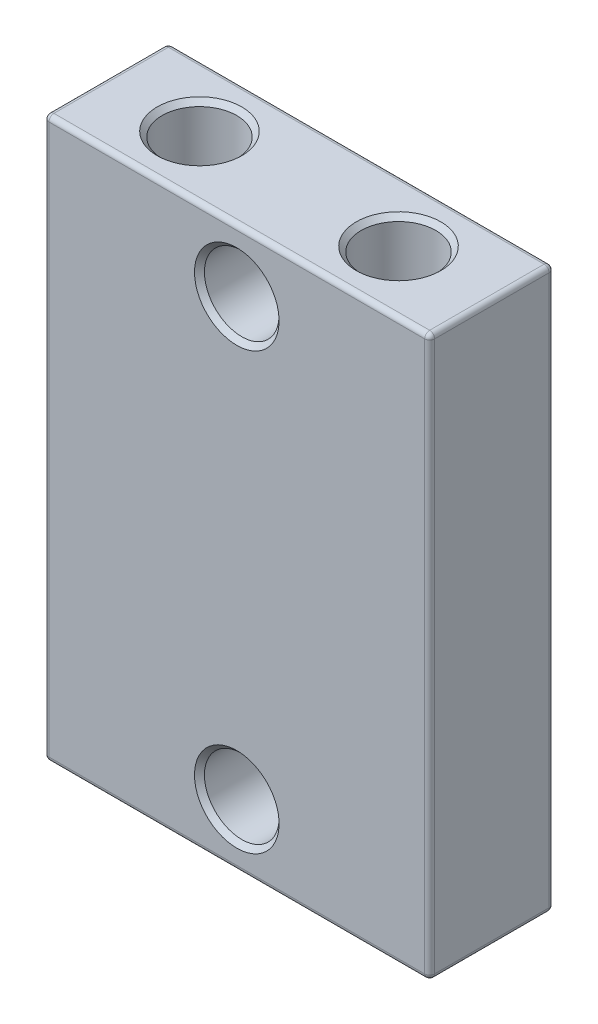
ISO-10303-21;
HEADER;
FILE_DESCRIPTION(('STEP AP214'),'2;1');
FILE_NAME('part.step','',(''),(''),'','','');
FILE_SCHEMA(('AUTOMOTIVE_DESIGN { 1 0 10303 214 1 1 1 1 }'));
ENDSEC;
DATA;
#1=APPLICATION_CONTEXT('core data for automotive mechanical design processes');
#2=APPLICATION_PROTOCOL_DEFINITION('international standard','automotive_design',2000,#1);
#3=PRODUCT_CONTEXT('',#1,'mechanical');
#4=PRODUCT('Part','Part','',(#3));
#5=PRODUCT_RELATED_PRODUCT_CATEGORY('part','',(#4));
#6=PRODUCT_DEFINITION_FORMATION('','',#4);
#7=PRODUCT_DEFINITION_CONTEXT('part definition',#1,'design');
#8=PRODUCT_DEFINITION('design','',#6,#7);
#9=PRODUCT_DEFINITION_SHAPE('','',#8);
#10=(LENGTH_UNIT() NAMED_UNIT(*) SI_UNIT(.MILLI.,.METRE.));
#11=(NAMED_UNIT(*) PLANE_ANGLE_UNIT() SI_UNIT($,.RADIAN.));
#12=(NAMED_UNIT(*) SI_UNIT($,.STERADIAN.) SOLID_ANGLE_UNIT());
#13=UNCERTAINTY_MEASURE_WITH_UNIT(LENGTH_MEASURE(1.E-05),#10,'distance_accuracy_value','');
#14=(GEOMETRIC_REPRESENTATION_CONTEXT(3) GLOBAL_UNCERTAINTY_ASSIGNED_CONTEXT((#13)) GLOBAL_UNIT_ASSIGNED_CONTEXT((#10,
#11,#12)) REPRESENTATION_CONTEXT('',''));
#15=CARTESIAN_POINT('',(0.,0.,0.));
#16=DIRECTION('',(0.,0.,1.));
#17=DIRECTION('',(1.,0.,0.));
#18=AXIS2_PLACEMENT_3D('',#15,#16,#17);
#19=CARTESIAN_POINT('',(7.75,-11.25,5.));
#20=DIRECTION('',(-1.,0.,0.));
#21=DIRECTION('',(0.,0.,1.));
#22=AXIS2_PLACEMENT_3D('',#19,#20,#21);
#23=PLANE('',#22);
#24=DIRECTION('',(0.,0.,-1.));
#25=VECTOR('',#24,1.);
#26=CARTESIAN_POINT('',(7.75,11.05,5.));
#27=LINE('',#26,#25);
#28=CARTESIAN_POINT('',(7.75,11.05,0.2));
#29=VERTEX_POINT('',#28);
#30=CARTESIAN_POINT('',(7.75,11.05,4.8));
#31=VERTEX_POINT('',#30);
#32=EDGE_CURVE('E165',#29,#31,#27,.F.);
#33=ORIENTED_EDGE('',*,*,#32,.T.);
#34=DIRECTION('',(0.,1.,0.));
#35=VECTOR('',#34,1.);
#36=CARTESIAN_POINT('',(7.75,-11.25,4.8));
#37=LINE('',#36,#35);
#38=CARTESIAN_POINT('',(7.75,-11.05,4.8));
#39=VERTEX_POINT('',#38);
#40=EDGE_CURVE('E128',#31,#39,#37,.F.);
#41=ORIENTED_EDGE('',*,*,#40,.T.);
#42=DIRECTION('',(0.,0.,-1.));
#43=VECTOR('',#42,1.);
#44=CARTESIAN_POINT('',(7.75,-11.05,5.));
#45=LINE('',#44,#43);
#46=CARTESIAN_POINT('',(7.75,-11.05,0.2));
#47=VERTEX_POINT('',#46);
#48=EDGE_CURVE('E157',#39,#47,#45,.T.);
#49=ORIENTED_EDGE('',*,*,#48,.T.);
#50=DIRECTION('',(0.,1.,0.));
#51=VECTOR('',#50,1.);
#52=CARTESIAN_POINT('',(7.75,11.25,0.2));
#53=LINE('',#52,#51);
#54=EDGE_CURVE('E159',#47,#29,#53,.T.);
#55=ORIENTED_EDGE('',*,*,#54,.T.);
#56=EDGE_LOOP('',(#33,#41,#49,#55));
#57=FACE_BOUND('',#56,.T.);
#58=ADVANCED_FACE('F33',(#57),#23,.F.);
#59=CARTESIAN_POINT('',(-7.75,11.25,5.));
#60=DIRECTION('',(0.,-1.,0.));
#61=DIRECTION('',(0.,0.,-1.));
#62=AXIS2_PLACEMENT_3D('',#59,#60,#61);
#63=PLANE('',#62);
#64=CARTESIAN_POINT('',(4.,11.25,2.5));
#65=DIRECTION('',(0.,-1.,0.));
#66=DIRECTION('',(0.,0.,-1.));
#67=AXIS2_PLACEMENT_3D('',#64,#65,#66);
#68=CIRCLE('',#67,1.70000000000001);
#69=CARTESIAN_POINT('',(4.,11.25,0.799999999999995));
#70=VERTEX_POINT('',#69);
#71=EDGE_CURVE('E41',#70,#70,#68,.T.);
#72=ORIENTED_EDGE('',*,*,#71,.T.);
#73=EDGE_LOOP('',(#72));
#74=FACE_BOUND('',#73,.T.);
#75=CARTESIAN_POINT('',(-4.,11.25,2.5));
#76=DIRECTION('',(0.,-1.,0.));
#77=DIRECTION('',(0.,0.,-1.));
#78=AXIS2_PLACEMENT_3D('',#75,#76,#77);
#79=CIRCLE('',#78,1.70000000000001);
#80=CARTESIAN_POINT('',(-4.,11.25,0.799999999999995));
#81=VERTEX_POINT('',#80);
#82=EDGE_CURVE('E278',#81,#81,#79,.T.);
#83=ORIENTED_EDGE('',*,*,#82,.T.);
#84=EDGE_LOOP('',(#83));
#85=FACE_BOUND('',#84,.T.);
#86=DIRECTION('',(0.,0.,-1.));
#87=VECTOR('',#86,1.);
#88=CARTESIAN_POINT('',(-7.55,11.25,5.));
#89=LINE('',#88,#87);
#90=CARTESIAN_POINT('',(-7.55,11.25,0.2));
#91=VERTEX_POINT('',#90);
#92=CARTESIAN_POINT('',(-7.55,11.25,4.8));
#93=VERTEX_POINT('',#92);
#94=EDGE_CURVE('E170',#91,#93,#89,.F.);
#95=ORIENTED_EDGE('',*,*,#94,.T.);
#96=DIRECTION('',(-1.,0.,0.));
#97=VECTOR('',#96,1.);
#98=CARTESIAN_POINT('',(-7.75,11.25,4.8));
#99=LINE('',#98,#97);
#100=CARTESIAN_POINT('',(7.55,11.25,4.8));
#101=VERTEX_POINT('',#100);
#102=EDGE_CURVE('E175',#93,#101,#99,.F.);
#103=ORIENTED_EDGE('',*,*,#102,.T.);
#104=DIRECTION('',(0.,0.,-1.));
#105=VECTOR('',#104,1.);
#106=CARTESIAN_POINT('',(7.55,11.25,5.));
#107=LINE('',#106,#105);
#108=CARTESIAN_POINT('',(7.55,11.25,0.2));
#109=VERTEX_POINT('',#108);
#110=EDGE_CURVE('E172',#101,#109,#107,.T.);
#111=ORIENTED_EDGE('',*,*,#110,.T.);
#112=DIRECTION('',(-1.,0.,0.));
#113=VECTOR('',#112,1.);
#114=CARTESIAN_POINT('',(-7.75,11.25,0.2));
#115=LINE('',#114,#113);
#116=EDGE_CURVE('E168',#109,#91,#115,.T.);
#117=ORIENTED_EDGE('',*,*,#116,.T.);
#118=EDGE_LOOP('',(#95,#103,#111,#117));
#119=FACE_BOUND('',#118,.T.);
#120=ADVANCED_FACE('F283',(#74,#85,#119),#63,.F.);
#121=CARTESIAN_POINT('',(-7.75,-11.25,5.));
#122=DIRECTION('',(1.,0.,0.));
#123=DIRECTION('',(0.,0.,-1.));
#124=AXIS2_PLACEMENT_3D('',#121,#122,#123);
#125=PLANE('',#124);
#126=DIRECTION('',(0.,-1.,0.));
#127=VECTOR('',#126,1.);
#128=CARTESIAN_POINT('',(-7.75,-11.25,4.8));
#129=LINE('',#128,#127);
#130=CARTESIAN_POINT('',(-7.75,-11.05,4.8));
#131=VERTEX_POINT('',#130);
#132=CARTESIAN_POINT('',(-7.75,11.05,4.8));
#133=VERTEX_POINT('',#132);
#134=EDGE_CURVE('E48',#131,#133,#129,.F.);
#135=ORIENTED_EDGE('',*,*,#134,.T.);
#136=DIRECTION('',(0.,0.,-1.));
#137=VECTOR('',#136,1.);
#138=CARTESIAN_POINT('',(-7.75,11.05,5.));
#139=LINE('',#138,#137);
#140=CARTESIAN_POINT('',(-7.75,11.05,0.2));
#141=VERTEX_POINT('',#140);
#142=EDGE_CURVE('E199',#133,#141,#139,.T.);
#143=ORIENTED_EDGE('',*,*,#142,.T.);
#144=DIRECTION('',(0.,-1.,0.));
#145=VECTOR('',#144,1.);
#146=CARTESIAN_POINT('',(-7.75,-11.25,0.2));
#147=LINE('',#146,#145);
#148=CARTESIAN_POINT('',(-7.75,-11.05,0.2));
#149=VERTEX_POINT('',#148);
#150=EDGE_CURVE('E195',#141,#149,#147,.T.);
#151=ORIENTED_EDGE('',*,*,#150,.T.);
#152=DIRECTION('',(0.,0.,-1.));
#153=VECTOR('',#152,1.);
#154=CARTESIAN_POINT('',(-7.75,-11.05,5.));
#155=LINE('',#154,#153);
#156=EDGE_CURVE('E53',#149,#131,#155,.F.);
#157=ORIENTED_EDGE('',*,*,#156,.T.);
#158=EDGE_LOOP('',(#135,#143,#151,#157));
#159=FACE_BOUND('',#158,.T.);
#160=ADVANCED_FACE('F360',(#159),#125,.F.);
#161=CARTESIAN_POINT('',(-7.75,-11.25,5.));
#162=DIRECTION('',(0.,1.,0.));
#163=DIRECTION('',(0.,0.,1.));
#164=AXIS2_PLACEMENT_3D('',#161,#162,#163);
#165=PLANE('',#164);
#166=DIRECTION('',(0.,0.,-1.));
#167=VECTOR('',#166,1.);
#168=CARTESIAN_POINT('',(7.55,-11.25,5.));
#169=LINE('',#168,#167);
#170=CARTESIAN_POINT('',(7.55,-11.25,0.2));
#171=VERTEX_POINT('',#170);
#172=CARTESIAN_POINT('',(7.55,-11.25,4.8));
#173=VERTEX_POINT('',#172);
#174=EDGE_CURVE('E190',#171,#173,#169,.F.);
#175=ORIENTED_EDGE('',*,*,#174,.T.);
#176=DIRECTION('',(1.,0.,0.));
#177=VECTOR('',#176,1.);
#178=CARTESIAN_POINT('',(-7.75,-11.25,4.8));
#179=LINE('',#178,#177);
#180=CARTESIAN_POINT('',(-7.55,-11.25,4.8));
#181=VERTEX_POINT('',#180);
#182=EDGE_CURVE('E192',#173,#181,#179,.F.);
#183=ORIENTED_EDGE('',*,*,#182,.T.);
#184=DIRECTION('',(0.,0.,-1.));
#185=VECTOR('',#184,1.);
#186=CARTESIAN_POINT('',(-7.55,-11.25,5.));
#187=LINE('',#186,#185);
#188=CARTESIAN_POINT('',(-7.55,-11.25,0.2));
#189=VERTEX_POINT('',#188);
#190=EDGE_CURVE('E186',#181,#189,#187,.T.);
#191=ORIENTED_EDGE('',*,*,#190,.T.);
#192=DIRECTION('',(1.,0.,0.));
#193=VECTOR('',#192,1.);
#194=CARTESIAN_POINT('',(7.75,-11.25,0.2));
#195=LINE('',#194,#193);
#196=EDGE_CURVE('E188',#189,#171,#195,.T.);
#197=ORIENTED_EDGE('',*,*,#196,.T.);
#198=EDGE_LOOP('',(#175,#183,#191,#197));
#199=FACE_BOUND('',#198,.T.);
#200=ADVANCED_FACE('F626',(#199),#165,.F.);
#201=CARTESIAN_POINT('',(0.,0.,5.));
#202=DIRECTION('',(0.,0.,-1.));
#203=DIRECTION('',(-1.,0.,0.));
#204=AXIS2_PLACEMENT_3D('',#201,#202,#203);
#205=PLANE('',#204);
#206=CARTESIAN_POINT('',(0.,-8.75,5.));
#207=DIRECTION('',(0.,0.,-1.));
#208=DIRECTION('',(-1.,0.,0.));
#209=AXIS2_PLACEMENT_3D('',#206,#207,#208);
#210=CIRCLE('',#209,1.7);
#211=CARTESIAN_POINT('',(-1.7,-8.75,5.));
#212=VERTEX_POINT('',#211);
#213=EDGE_CURVE('E263',#212,#212,#210,.T.);
#214=ORIENTED_EDGE('',*,*,#213,.T.);
#215=EDGE_LOOP('',(#214));
#216=FACE_BOUND('',#215,.T.);
#217=CARTESIAN_POINT('',(0.,8.75,5.));
#218=DIRECTION('',(0.,0.,-1.));
#219=DIRECTION('',(-1.,0.,0.));
#220=AXIS2_PLACEMENT_3D('',#217,#218,#219);
#221=CIRCLE('',#220,1.7);
#222=CARTESIAN_POINT('',(-1.7,8.75,5.));
#223=VERTEX_POINT('',#222);
#224=EDGE_CURVE('E260',#223,#223,#221,.T.);
#225=ORIENTED_EDGE('',*,*,#224,.T.);
#226=EDGE_LOOP('',(#225));
#227=FACE_BOUND('',#226,.T.);
#228=DIRECTION('',(1.,0.,0.));
#229=VECTOR('',#228,1.);
#230=CARTESIAN_POINT('',(0.,-11.05,5.));
#231=LINE('',#230,#229);
#232=CARTESIAN_POINT('',(-7.55,-11.05,5.));
#233=VERTEX_POINT('',#232);
#234=CARTESIAN_POINT('',(7.55,-11.05,5.));
#235=VERTEX_POINT('',#234);
#236=EDGE_CURVE('E155',#233,#235,#231,.T.);
#237=ORIENTED_EDGE('',*,*,#236,.T.);
#238=DIRECTION('',(0.,1.,0.));
#239=VECTOR('',#238,1.);
#240=CARTESIAN_POINT('',(7.55,0.,5.));
#241=LINE('',#240,#239);
#242=CARTESIAN_POINT('',(7.55,11.05,5.));
#243=VERTEX_POINT('',#242);
#244=EDGE_CURVE('E126',#235,#243,#241,.T.);
#245=ORIENTED_EDGE('',*,*,#244,.T.);
#246=DIRECTION('',(-1.,0.,0.));
#247=VECTOR('',#246,1.);
#248=CARTESIAN_POINT('',(0.,11.05,5.));
#249=LINE('',#248,#247);
#250=CARTESIAN_POINT('',(-7.55,11.05,5.));
#251=VERTEX_POINT('',#250);
#252=EDGE_CURVE('E144',#243,#251,#249,.T.);
#253=ORIENTED_EDGE('',*,*,#252,.T.);
#254=DIRECTION('',(0.,-1.,0.));
#255=VECTOR('',#254,1.);
#256=CARTESIAN_POINT('',(-7.55,0.,5.));
#257=LINE('',#256,#255);
#258=EDGE_CURVE('E150',#251,#233,#257,.T.);
#259=ORIENTED_EDGE('',*,*,#258,.T.);
#260=EDGE_LOOP('',(#237,#245,#253,#259));
#261=FACE_BOUND('',#260,.T.);
#262=ADVANCED_FACE('F153',(#216,#227,#261),#205,.F.);
#263=CARTESIAN_POINT('',(0.,0.,0.));
#264=DIRECTION('',(0.,0.,-1.));
#265=DIRECTION('',(-1.,0.,0.));
#266=AXIS2_PLACEMENT_3D('',#263,#264,#265);
#267=PLANE('',#266);
#268=CARTESIAN_POINT('',(0.,8.75,0.));
#269=DIRECTION('',(0.,0.,-1.));
#270=DIRECTION('',(-1.,0.,0.));
#271=AXIS2_PLACEMENT_3D('',#268,#269,#270);
#272=CIRCLE('',#271,1.7);
#273=CARTESIAN_POINT('',(-1.7,8.75,0.));
#274=VERTEX_POINT('',#273);
#275=EDGE_CURVE('E272',#274,#274,#272,.F.);
#276=ORIENTED_EDGE('',*,*,#275,.T.);
#277=EDGE_LOOP('',(#276));
#278=FACE_BOUND('',#277,.T.);
#279=DIRECTION('',(-1.,0.,0.));
#280=VECTOR('',#279,1.);
#281=CARTESIAN_POINT('',(7.75,11.05,0.));
#282=LINE('',#281,#280);
#283=CARTESIAN_POINT('',(-7.55,11.05,0.));
#284=VERTEX_POINT('',#283);
#285=CARTESIAN_POINT('',(7.55,11.05,0.));
#286=VERTEX_POINT('',#285);
#287=EDGE_CURVE('E177',#284,#286,#282,.F.);
#288=ORIENTED_EDGE('',*,*,#287,.T.);
#289=DIRECTION('',(0.,1.,0.));
#290=VECTOR('',#289,1.);
#291=CARTESIAN_POINT('',(7.55,-11.25,0.));
#292=LINE('',#291,#290);
#293=CARTESIAN_POINT('',(7.55,-11.05,0.));
#294=VERTEX_POINT('',#293);
#295=EDGE_CURVE('E183',#286,#294,#292,.F.);
#296=ORIENTED_EDGE('',*,*,#295,.T.);
#297=DIRECTION('',(1.,0.,0.));
#298=VECTOR('',#297,1.);
#299=CARTESIAN_POINT('',(-7.75,-11.05,0.));
#300=LINE('',#299,#298);
#301=CARTESIAN_POINT('',(-7.55,-11.05,0.));
#302=VERTEX_POINT('',#301);
#303=EDGE_CURVE('E181',#294,#302,#300,.F.);
#304=ORIENTED_EDGE('',*,*,#303,.T.);
#305=DIRECTION('',(0.,-1.,0.));
#306=VECTOR('',#305,1.);
#307=CARTESIAN_POINT('',(-7.55,11.25,0.));
#308=LINE('',#307,#306);
#309=EDGE_CURVE('E179',#302,#284,#308,.F.);
#310=ORIENTED_EDGE('',*,*,#309,.T.);
#311=EDGE_LOOP('',(#288,#296,#304,#310));
#312=FACE_BOUND('',#311,.T.);
#313=CARTESIAN_POINT('',(0.,-8.75,0.));
#314=DIRECTION('',(0.,0.,1.));
#315=DIRECTION('',(1.,0.,0.));
#316=AXIS2_PLACEMENT_3D('',#313,#314,#315);
#317=CIRCLE('',#316,1.5);
#318=CARTESIAN_POINT('',(1.5,-8.75,0.));
#319=VERTEX_POINT('',#318);
#320=EDGE_CURVE('E151',#319,#319,#317,.T.);
#321=ORIENTED_EDGE('',*,*,#320,.T.);
#322=EDGE_LOOP('',(#321));
#323=FACE_BOUND('',#322,.T.);
#324=ADVANCED_FACE('F609',(#278,#312,#323),#267,.T.);
#325=CARTESIAN_POINT('',(0.,8.75,0.));
#326=DIRECTION('',(0.,0.,1.));
#327=DIRECTION('',(1.,0.,0.));
#328=AXIS2_PLACEMENT_3D('',#325,#326,#327);
#329=CYLINDRICAL_SURFACE('',#328,1.5);
#330=CARTESIAN_POINT('',(0.,8.75,4.80000000000001));
#331=DIRECTION('',(0.,0.,-1.));
#332=DIRECTION('',(-1.,0.,0.));
#333=AXIS2_PLACEMENT_3D('',#330,#331,#332);
#334=CIRCLE('',#333,1.5);
#335=CARTESIAN_POINT('',(-1.5,8.75,4.80000000000001));
#336=VERTEX_POINT('',#335);
#337=EDGE_CURVE('E269',#336,#336,#334,.F.);
#338=ORIENTED_EDGE('',*,*,#337,.T.);
#339=EDGE_LOOP('',(#338));
#340=FACE_BOUND('',#339,.T.);
#341=CARTESIAN_POINT('',(0.,8.75,0.199999999999999));
#342=DIRECTION('',(0.,0.,-1.));
#343=DIRECTION('',(-1.,0.,0.));
#344=AXIS2_PLACEMENT_3D('',#341,#342,#343);
#345=CIRCLE('',#344,1.5);
#346=CARTESIAN_POINT('',(-1.5,8.75,0.199999999999999));
#347=VERTEX_POINT('',#346);
#348=EDGE_CURVE('E266',#347,#347,#345,.T.);
#349=ORIENTED_EDGE('',*,*,#348,.T.);
#350=EDGE_LOOP('',(#349));
#351=FACE_BOUND('',#350,.T.);
#352=ADVANCED_FACE('F600',(#340,#351),#329,.F.);
#353=CARTESIAN_POINT('',(0.,-8.75,0.));
#354=DIRECTION('',(0.,0.,1.));
#355=DIRECTION('',(1.,0.,0.));
#356=AXIS2_PLACEMENT_3D('',#353,#354,#355);
#357=CYLINDRICAL_SURFACE('',#356,1.5);
#358=CARTESIAN_POINT('',(0.,-8.75,4.80000000000001));
#359=DIRECTION('',(0.,0.,-1.));
#360=DIRECTION('',(-1.,0.,0.));
#361=AXIS2_PLACEMENT_3D('',#358,#359,#360);
#362=CIRCLE('',#361,1.5);
#363=CARTESIAN_POINT('',(-1.5,-8.75,4.80000000000001));
#364=VERTEX_POINT('',#363);
#365=EDGE_CURVE('E200',#364,#364,#362,.F.);
#366=ORIENTED_EDGE('',*,*,#365,.T.);
#367=EDGE_LOOP('',(#366));
#368=FACE_BOUND('',#367,.T.);
#369=ORIENTED_EDGE('',*,*,#320,.F.);
#370=EDGE_LOOP('',(#369));
#371=FACE_BOUND('',#370,.T.);
#372=ADVANCED_FACE('F591',(#368,#371),#357,.F.);
#373=CARTESIAN_POINT('',(-4.,3.25,2.5));
#374=DIRECTION('',(0.,1.,0.));
#375=DIRECTION('',(0.,0.,1.));
#376=AXIS2_PLACEMENT_3D('',#373,#374,#375);
#377=CYLINDRICAL_SURFACE('',#376,1.5);
#378=CARTESIAN_POINT('',(-4.,11.05,2.5));
#379=DIRECTION('',(0.,-1.,0.));
#380=DIRECTION('',(0.,0.,-1.));
#381=AXIS2_PLACEMENT_3D('',#378,#379,#380);
#382=CIRCLE('',#381,1.5);
#383=CARTESIAN_POINT('',(-4.,11.05,1.));
#384=VERTEX_POINT('',#383);
#385=EDGE_CURVE('E11',#384,#384,#382,.F.);
#386=ORIENTED_EDGE('',*,*,#385,.T.);
#387=EDGE_LOOP('',(#386));
#388=FACE_BOUND('',#387,.T.);
#389=CARTESIAN_POINT('',(-4.,3.25,2.5));
#390=DIRECTION('',(0.,1.,0.));
#391=DIRECTION('',(0.,0.,1.));
#392=AXIS2_PLACEMENT_3D('',#389,#390,#391);
#393=CIRCLE('',#392,1.5);
#394=CARTESIAN_POINT('',(-4.,3.25,4.));
#395=VERTEX_POINT('',#394);
#396=EDGE_CURVE('E301',#395,#395,#393,.T.);
#397=ORIENTED_EDGE('',*,*,#396,.F.);
#398=EDGE_LOOP('',(#397));
#399=FACE_BOUND('',#398,.T.);
#400=ADVANCED_FACE('F583',(#388,#399),#377,.F.);
#401=CARTESIAN_POINT('',(-4.,3.25,2.5));
#402=DIRECTION('',(0.,1.,0.));
#403=DIRECTION('',(0.,0.,1.));
#404=AXIS2_PLACEMENT_3D('',#401,#402,#403);
#405=PLANE('',#404);
#406=ORIENTED_EDGE('',*,*,#396,.T.);
#407=EDGE_LOOP('',(#406));
#408=FACE_BOUND('',#407,.T.);
#409=ADVANCED_FACE('F296',(#408),#405,.T.);
#410=CARTESIAN_POINT('',(4.,3.25,2.5));
#411=DIRECTION('',(0.,1.,0.));
#412=DIRECTION('',(0.,0.,1.));
#413=AXIS2_PLACEMENT_3D('',#410,#411,#412);
#414=CYLINDRICAL_SURFACE('',#413,1.5);
#415=CARTESIAN_POINT('',(4.,11.05,2.5));
#416=DIRECTION('',(0.,-1.,0.));
#417=DIRECTION('',(0.,0.,-1.));
#418=AXIS2_PLACEMENT_3D('',#415,#416,#417);
#419=CIRCLE('',#418,1.5);
#420=CARTESIAN_POINT('',(4.,11.05,1.));
#421=VERTEX_POINT('',#420);
#422=EDGE_CURVE('E275',#421,#421,#419,.F.);
#423=ORIENTED_EDGE('',*,*,#422,.T.);
#424=EDGE_LOOP('',(#423));
#425=FACE_BOUND('',#424,.T.);
#426=CARTESIAN_POINT('',(4.,3.25,2.5));
#427=DIRECTION('',(0.,1.,0.));
#428=DIRECTION('',(0.,0.,1.));
#429=AXIS2_PLACEMENT_3D('',#426,#427,#428);
#430=CIRCLE('',#429,1.5);
#431=CARTESIAN_POINT('',(4.,3.25,4.));
#432=VERTEX_POINT('',#431);
#433=EDGE_CURVE('E257',#432,#432,#430,.T.);
#434=ORIENTED_EDGE('',*,*,#433,.F.);
#435=EDGE_LOOP('',(#434));
#436=FACE_BOUND('',#435,.T.);
#437=ADVANCED_FACE('F292',(#425,#436),#414,.F.);
#438=CARTESIAN_POINT('',(4.,3.25,2.5));
#439=DIRECTION('',(0.,1.,0.));
#440=DIRECTION('',(0.,0.,1.));
#441=AXIS2_PLACEMENT_3D('',#438,#439,#440);
#442=PLANE('',#441);
#443=ORIENTED_EDGE('',*,*,#433,.T.);
#444=EDGE_LOOP('',(#443));
#445=FACE_BOUND('',#444,.T.);
#446=ADVANCED_FACE('F295',(#445),#442,.T.);
#447=CARTESIAN_POINT('',(-7.55,-11.25,0.2));
#448=DIRECTION('',(0.,1.,0.));
#449=DIRECTION('',(0.,0.,1.));
#450=AXIS2_PLACEMENT_3D('',#447,#448,#449);
#451=CYLINDRICAL_SURFACE('',#450,0.2);
#452=CARTESIAN_POINT('',(-7.55,-11.05,0.2));
#453=DIRECTION('',(0.,-1.,0.));
#454=DIRECTION('',(0.,0.,-1.));
#455=AXIS2_PLACEMENT_3D('',#452,#453,#454);
#456=CIRCLE('',#455,0.2);
#457=EDGE_CURVE('E254',#149,#302,#456,.T.);
#458=ORIENTED_EDGE('',*,*,#457,.F.);
#459=ORIENTED_EDGE('',*,*,#150,.F.);
#460=CARTESIAN_POINT('',(-7.55,11.05,0.2));
#461=DIRECTION('',(0.,1.,0.));
#462=DIRECTION('',(-1.,0.,0.));
#463=AXIS2_PLACEMENT_3D('',#460,#461,#462);
#464=CIRCLE('',#463,0.2);
#465=EDGE_CURVE('E251',#284,#141,#464,.T.);
#466=ORIENTED_EDGE('',*,*,#465,.F.);
#467=ORIENTED_EDGE('',*,*,#309,.F.);
#468=EDGE_LOOP('',(#458,#459,#466,#467));
#469=FACE_BOUND('',#468,.T.);
#470=ADVANCED_FACE('F553',(#469),#451,.T.);
#471=CARTESIAN_POINT('',(-7.55,-11.05,0.2));
#472=DIRECTION('',(0.,0.,1.));
#473=DIRECTION('',(1.,0.,0.));
#474=AXIS2_PLACEMENT_3D('',#471,#472,#473);
#475=SPHERICAL_SURFACE('',#474,0.2);
#476=CARTESIAN_POINT('',(-7.55,-11.05,0.2));
#477=DIRECTION('',(0.,0.,-1.));
#478=DIRECTION('',(-1.,0.,0.));
#479=AXIS2_PLACEMENT_3D('',#476,#477,#478);
#480=CIRCLE('',#479,0.2);
#481=EDGE_CURVE('E245',#149,#189,#480,.F.);
#482=ORIENTED_EDGE('',*,*,#481,.F.);
#483=ORIENTED_EDGE('',*,*,#457,.T.);
#484=CARTESIAN_POINT('',(-7.55,-11.05,0.2));
#485=DIRECTION('',(-1.,0.,0.));
#486=DIRECTION('',(0.,0.,1.));
#487=AXIS2_PLACEMENT_3D('',#484,#485,#486);
#488=CIRCLE('',#487,0.2);
#489=EDGE_CURVE('E248',#189,#302,#488,.F.);
#490=ORIENTED_EDGE('',*,*,#489,.F.);
#491=EDGE_LOOP('',(#482,#483,#490));
#492=FACE_BOUND('',#491,.T.);
#493=ADVANCED_FACE('F544',(#492),#475,.T.);
#494=CARTESIAN_POINT('',(-7.55,11.05,0.2));
#495=DIRECTION('',(0.,0.,1.));
#496=DIRECTION('',(1.,0.,0.));
#497=AXIS2_PLACEMENT_3D('',#494,#495,#496);
#498=SPHERICAL_SURFACE('',#497,0.2);
#499=CARTESIAN_POINT('',(-7.55,11.05,0.2));
#500=DIRECTION('',(-1.,0.,0.));
#501=DIRECTION('',(0.,0.,1.));
#502=AXIS2_PLACEMENT_3D('',#499,#500,#501);
#503=CIRCLE('',#502,0.2);
#504=EDGE_CURVE('E240',#284,#91,#503,.F.);
#505=ORIENTED_EDGE('',*,*,#504,.F.);
#506=ORIENTED_EDGE('',*,*,#465,.T.);
#507=CARTESIAN_POINT('',(-7.55,11.05,0.2));
#508=DIRECTION('',(0.,0.,-1.));
#509=DIRECTION('',(-1.,0.,0.));
#510=AXIS2_PLACEMENT_3D('',#507,#508,#509);
#511=CIRCLE('',#510,0.2);
#512=EDGE_CURVE('E243',#91,#141,#511,.F.);
#513=ORIENTED_EDGE('',*,*,#512,.F.);
#514=EDGE_LOOP('',(#505,#506,#513));
#515=FACE_BOUND('',#514,.T.);
#516=ADVANCED_FACE('F535',(#515),#498,.T.);
#517=CARTESIAN_POINT('',(-7.75,-11.05,0.2));
#518=DIRECTION('',(-1.,0.,0.));
#519=DIRECTION('',(0.,0.,1.));
#520=AXIS2_PLACEMENT_3D('',#517,#518,#519);
#521=CYLINDRICAL_SURFACE('',#520,0.2);
#522=ORIENTED_EDGE('',*,*,#489,.T.);
#523=ORIENTED_EDGE('',*,*,#303,.F.);
#524=CARTESIAN_POINT('',(7.55,-11.05,0.2));
#525=DIRECTION('',(1.,0.,0.));
#526=DIRECTION('',(0.,0.,-1.));
#527=AXIS2_PLACEMENT_3D('',#524,#525,#526);
#528=CIRCLE('',#527,0.2);
#529=EDGE_CURVE('E235',#171,#294,#528,.T.);
#530=ORIENTED_EDGE('',*,*,#529,.F.);
#531=ORIENTED_EDGE('',*,*,#196,.F.);
#532=EDGE_LOOP('',(#522,#523,#530,#531));
#533=FACE_BOUND('',#532,.T.);
#534=ADVANCED_FACE('F526',(#533),#521,.T.);
#535=CARTESIAN_POINT('',(-7.55,-11.05,5.));
#536=DIRECTION('',(0.,0.,-1.));
#537=DIRECTION('',(-1.,0.,0.));
#538=AXIS2_PLACEMENT_3D('',#535,#536,#537);
#539=CYLINDRICAL_SURFACE('',#538,0.2);
#540=ORIENTED_EDGE('',*,*,#481,.T.);
#541=ORIENTED_EDGE('',*,*,#190,.F.);
#542=CARTESIAN_POINT('',(-7.55,-11.05,4.8));
#543=DIRECTION('',(0.,0.,1.));
#544=DIRECTION('',(1.,0.,0.));
#545=AXIS2_PLACEMENT_3D('',#542,#543,#544);
#546=CIRCLE('',#545,0.2);
#547=EDGE_CURVE('E232',#131,#181,#546,.T.);
#548=ORIENTED_EDGE('',*,*,#547,.F.);
#549=ORIENTED_EDGE('',*,*,#156,.F.);
#550=EDGE_LOOP('',(#540,#541,#548,#549));
#551=FACE_BOUND('',#550,.T.);
#552=ADVANCED_FACE('F518',(#551),#539,.T.);
#553=CARTESIAN_POINT('',(-7.55,0.,4.8));
#554=DIRECTION('',(0.,-1.,0.));
#555=DIRECTION('',(0.,0.,-1.));
#556=AXIS2_PLACEMENT_3D('',#553,#554,#555);
#557=CYLINDRICAL_SURFACE('',#556,0.2);
#558=CARTESIAN_POINT('',(-7.55,11.05,4.8));
#559=DIRECTION('',(0.,1.,0.));
#560=DIRECTION('',(0.,0.,1.));
#561=AXIS2_PLACEMENT_3D('',#558,#559,#560);
#562=CIRCLE('',#561,0.2);
#563=EDGE_CURVE('E226',#133,#251,#562,.T.);
#564=ORIENTED_EDGE('',*,*,#563,.F.);
#565=ORIENTED_EDGE('',*,*,#134,.F.);
#566=CARTESIAN_POINT('',(-7.55,-11.05,4.8));
#567=DIRECTION('',(0.,-1.,0.));
#568=DIRECTION('',(0.,0.,-1.));
#569=AXIS2_PLACEMENT_3D('',#566,#567,#568);
#570=CIRCLE('',#569,0.2);
#571=EDGE_CURVE('E229',#233,#131,#570,.T.);
#572=ORIENTED_EDGE('',*,*,#571,.F.);
#573=ORIENTED_EDGE('',*,*,#258,.F.);
#574=EDGE_LOOP('',(#564,#565,#572,#573));
#575=FACE_BOUND('',#574,.T.);
#576=ADVANCED_FACE('F311',(#575),#557,.T.);
#577=CARTESIAN_POINT('',(-7.55,11.05,5.));
#578=DIRECTION('',(0.,0.,-1.));
#579=DIRECTION('',(-1.,0.,0.));
#580=AXIS2_PLACEMENT_3D('',#577,#578,#579);
#581=CYLINDRICAL_SURFACE('',#580,0.2);
#582=ORIENTED_EDGE('',*,*,#512,.T.);
#583=ORIENTED_EDGE('',*,*,#142,.F.);
#584=CARTESIAN_POINT('',(-7.55,11.05,4.8));
#585=DIRECTION('',(0.,0.,1.));
#586=DIRECTION('',(1.,0.,0.));
#587=AXIS2_PLACEMENT_3D('',#584,#585,#586);
#588=CIRCLE('',#587,0.2);
#589=EDGE_CURVE('E223',#93,#133,#588,.T.);
#590=ORIENTED_EDGE('',*,*,#589,.F.);
#591=ORIENTED_EDGE('',*,*,#94,.F.);
#592=EDGE_LOOP('',(#582,#583,#590,#591));
#593=FACE_BOUND('',#592,.T.);
#594=ADVANCED_FACE('F341',(#593),#581,.T.);
#595=CARTESIAN_POINT('',(-7.75,11.05,0.2));
#596=DIRECTION('',(1.,0.,0.));
#597=DIRECTION('',(0.,0.,-1.));
#598=AXIS2_PLACEMENT_3D('',#595,#596,#597);
#599=CYLINDRICAL_SURFACE('',#598,0.2);
#600=ORIENTED_EDGE('',*,*,#504,.T.);
#601=ORIENTED_EDGE('',*,*,#116,.F.);
#602=CARTESIAN_POINT('',(7.55,11.05,0.2));
#603=DIRECTION('',(1.,0.,0.));
#604=DIRECTION('',(0.,1.,0.));
#605=AXIS2_PLACEMENT_3D('',#602,#603,#604);
#606=CIRCLE('',#605,0.2);
#607=EDGE_CURVE('E220',#286,#109,#606,.T.);
#608=ORIENTED_EDGE('',*,*,#607,.F.);
#609=ORIENTED_EDGE('',*,*,#287,.F.);
#610=EDGE_LOOP('',(#600,#601,#608,#609));
#611=FACE_BOUND('',#610,.T.);
#612=ADVANCED_FACE('F494',(#611),#599,.T.);
#613=CARTESIAN_POINT('',(7.55,-11.25,0.2));
#614=DIRECTION('',(0.,-1.,0.));
#615=DIRECTION('',(0.,0.,-1.));
#616=AXIS2_PLACEMENT_3D('',#613,#614,#615);
#617=CYLINDRICAL_SURFACE('',#616,0.2);
#618=CARTESIAN_POINT('',(7.55,-11.05,0.2));
#619=DIRECTION('',(0.,-1.,0.));
#620=DIRECTION('',(0.,0.,-1.));
#621=AXIS2_PLACEMENT_3D('',#618,#619,#620);
#622=CIRCLE('',#621,0.2);
#623=EDGE_CURVE('E237',#294,#47,#622,.T.);
#624=ORIENTED_EDGE('',*,*,#623,.F.);
#625=ORIENTED_EDGE('',*,*,#295,.F.);
#626=CARTESIAN_POINT('',(7.55,11.05,0.2));
#627=DIRECTION('',(0.,1.,0.));
#628=DIRECTION('',(0.,0.,1.));
#629=AXIS2_PLACEMENT_3D('',#626,#627,#628);
#630=CIRCLE('',#629,0.2);
#631=EDGE_CURVE('E217',#29,#286,#630,.T.);
#632=ORIENTED_EDGE('',*,*,#631,.F.);
#633=ORIENTED_EDGE('',*,*,#54,.F.);
#634=EDGE_LOOP('',(#624,#625,#632,#633));
#635=FACE_BOUND('',#634,.T.);
#636=ADVANCED_FACE('F485',(#635),#617,.T.);
#637=CARTESIAN_POINT('',(7.55,-11.05,0.2));
#638=DIRECTION('',(0.,0.,1.));
#639=DIRECTION('',(1.,0.,0.));
#640=AXIS2_PLACEMENT_3D('',#637,#638,#639);
#641=SPHERICAL_SURFACE('',#640,0.2);
#642=ORIENTED_EDGE('',*,*,#529,.T.);
#643=ORIENTED_EDGE('',*,*,#623,.T.);
#644=CARTESIAN_POINT('',(7.55,-11.05,0.2));
#645=DIRECTION('',(0.,0.,-1.));
#646=DIRECTION('',(-1.,0.,0.));
#647=AXIS2_PLACEMENT_3D('',#644,#645,#646);
#648=CIRCLE('',#647,0.2);
#649=EDGE_CURVE('E214',#171,#47,#648,.F.);
#650=ORIENTED_EDGE('',*,*,#649,.F.);
#651=EDGE_LOOP('',(#642,#643,#650));
#652=FACE_BOUND('',#651,.T.);
#653=ADVANCED_FACE('F353',(#652),#641,.T.);
#654=CARTESIAN_POINT('',(-7.55,-11.05,4.8));
#655=DIRECTION('',(0.,0.,1.));
#656=DIRECTION('',(1.,0.,0.));
#657=AXIS2_PLACEMENT_3D('',#654,#655,#656);
#658=SPHERICAL_SURFACE('',#657,0.2);
#659=ORIENTED_EDGE('',*,*,#571,.T.);
#660=ORIENTED_EDGE('',*,*,#547,.T.);
#661=CARTESIAN_POINT('',(-7.55,-11.05,4.8));
#662=DIRECTION('',(-1.,0.,0.));
#663=DIRECTION('',(0.,0.,1.));
#664=AXIS2_PLACEMENT_3D('',#661,#662,#663);
#665=CIRCLE('',#664,0.2);
#666=EDGE_CURVE('E212',#233,#181,#665,.F.);
#667=ORIENTED_EDGE('',*,*,#666,.F.);
#668=EDGE_LOOP('',(#659,#660,#667));
#669=FACE_BOUND('',#668,.T.);
#670=ADVANCED_FACE('F314',(#669),#658,.T.);
#671=CARTESIAN_POINT('',(-7.55,11.05,4.8));
#672=DIRECTION('',(0.,0.,1.));
#673=DIRECTION('',(1.,0.,0.));
#674=AXIS2_PLACEMENT_3D('',#671,#672,#673);
#675=SPHERICAL_SURFACE('',#674,0.2);
#676=ORIENTED_EDGE('',*,*,#589,.T.);
#677=ORIENTED_EDGE('',*,*,#563,.T.);
#678=CARTESIAN_POINT('',(-7.55,11.05,4.8));
#679=DIRECTION('',(-1.,0.,0.));
#680=DIRECTION('',(0.,0.,1.));
#681=AXIS2_PLACEMENT_3D('',#678,#679,#680);
#682=CIRCLE('',#681,0.2);
#683=EDGE_CURVE('E147',#93,#251,#682,.F.);
#684=ORIENTED_EDGE('',*,*,#683,.F.);
#685=EDGE_LOOP('',(#676,#677,#684));
#686=FACE_BOUND('',#685,.T.);
#687=ADVANCED_FACE('F343',(#686),#675,.T.);
#688=CARTESIAN_POINT('',(7.55,11.05,0.2));
#689=DIRECTION('',(0.,0.,1.));
#690=DIRECTION('',(1.,0.,0.));
#691=AXIS2_PLACEMENT_3D('',#688,#689,#690);
#692=SPHERICAL_SURFACE('',#691,0.2);
#693=ORIENTED_EDGE('',*,*,#631,.T.);
#694=ORIENTED_EDGE('',*,*,#607,.T.);
#695=CARTESIAN_POINT('',(7.55,11.05,0.2));
#696=DIRECTION('',(0.,0.,-1.));
#697=DIRECTION('',(-1.,0.,0.));
#698=AXIS2_PLACEMENT_3D('',#695,#696,#697);
#699=CIRCLE('',#698,0.2);
#700=EDGE_CURVE('E209',#29,#109,#699,.F.);
#701=ORIENTED_EDGE('',*,*,#700,.F.);
#702=EDGE_LOOP('',(#693,#694,#701));
#703=FACE_BOUND('',#702,.T.);
#704=ADVANCED_FACE('F345',(#703),#692,.T.);
#705=CARTESIAN_POINT('',(7.55,-11.05,5.));
#706=DIRECTION('',(0.,0.,-1.));
#707=DIRECTION('',(-1.,0.,0.));
#708=AXIS2_PLACEMENT_3D('',#705,#706,#707);
#709=CYLINDRICAL_SURFACE('',#708,0.2);
#710=ORIENTED_EDGE('',*,*,#649,.T.);
#711=ORIENTED_EDGE('',*,*,#48,.F.);
#712=CARTESIAN_POINT('',(7.55,-11.05,4.8));
#713=DIRECTION('',(0.,0.,1.));
#714=DIRECTION('',(1.,0.,0.));
#715=AXIS2_PLACEMENT_3D('',#712,#713,#714);
#716=CIRCLE('',#715,0.2);
#717=EDGE_CURVE('E206',#173,#39,#716,.T.);
#718=ORIENTED_EDGE('',*,*,#717,.F.);
#719=ORIENTED_EDGE('',*,*,#174,.F.);
#720=EDGE_LOOP('',(#710,#711,#718,#719));
#721=FACE_BOUND('',#720,.T.);
#722=ADVANCED_FACE('F326',(#721),#709,.T.);
#723=CARTESIAN_POINT('',(0.,-11.05,4.8));
#724=DIRECTION('',(1.,0.,0.));
#725=DIRECTION('',(0.,0.,-1.));
#726=AXIS2_PLACEMENT_3D('',#723,#724,#725);
#727=CYLINDRICAL_SURFACE('',#726,0.2);
#728=ORIENTED_EDGE('',*,*,#666,.T.);
#729=ORIENTED_EDGE('',*,*,#182,.F.);
#730=CARTESIAN_POINT('',(7.55,-11.05,4.8));
#731=DIRECTION('',(1.,0.,0.));
#732=DIRECTION('',(0.,0.,-1.));
#733=AXIS2_PLACEMENT_3D('',#730,#731,#732);
#734=CIRCLE('',#733,0.2);
#735=EDGE_CURVE('E141',#235,#173,#734,.T.);
#736=ORIENTED_EDGE('',*,*,#735,.F.);
#737=ORIENTED_EDGE('',*,*,#236,.F.);
#738=EDGE_LOOP('',(#728,#729,#736,#737));
#739=FACE_BOUND('',#738,.T.);
#740=ADVANCED_FACE('F318',(#739),#727,.T.);
#741=CARTESIAN_POINT('',(0.,11.05,4.8));
#742=DIRECTION('',(-1.,0.,0.));
#743=DIRECTION('',(0.,0.,1.));
#744=AXIS2_PLACEMENT_3D('',#741,#742,#743);
#745=CYLINDRICAL_SURFACE('',#744,0.2);
#746=ORIENTED_EDGE('',*,*,#683,.T.);
#747=ORIENTED_EDGE('',*,*,#252,.F.);
#748=CARTESIAN_POINT('',(7.55,11.05,4.8));
#749=DIRECTION('',(1.,0.,0.));
#750=DIRECTION('',(0.,0.,-1.));
#751=AXIS2_PLACEMENT_3D('',#748,#749,#750);
#752=CIRCLE('',#751,0.2);
#753=EDGE_CURVE('E134',#101,#243,#752,.T.);
#754=ORIENTED_EDGE('',*,*,#753,.F.);
#755=ORIENTED_EDGE('',*,*,#102,.F.);
#756=EDGE_LOOP('',(#746,#747,#754,#755));
#757=FACE_BOUND('',#756,.T.);
#758=ADVANCED_FACE('F145',(#757),#745,.T.);
#759=CARTESIAN_POINT('',(7.55,11.05,5.));
#760=DIRECTION('',(0.,0.,-1.));
#761=DIRECTION('',(-1.,0.,0.));
#762=AXIS2_PLACEMENT_3D('',#759,#760,#761);
#763=CYLINDRICAL_SURFACE('',#762,0.2);
#764=ORIENTED_EDGE('',*,*,#700,.T.);
#765=ORIENTED_EDGE('',*,*,#110,.F.);
#766=CARTESIAN_POINT('',(7.55,11.05,4.8));
#767=DIRECTION('',(0.,0.,1.));
#768=DIRECTION('',(1.,0.,0.));
#769=AXIS2_PLACEMENT_3D('',#766,#767,#768);
#770=CIRCLE('',#769,0.2);
#771=EDGE_CURVE('E138',#31,#101,#770,.T.);
#772=ORIENTED_EDGE('',*,*,#771,.F.);
#773=ORIENTED_EDGE('',*,*,#32,.F.);
#774=EDGE_LOOP('',(#764,#765,#772,#773));
#775=FACE_BOUND('',#774,.T.);
#776=ADVANCED_FACE('F334',(#775),#763,.T.);
#777=CARTESIAN_POINT('',(7.55,-11.05,4.8));
#778=DIRECTION('',(0.,0.,1.));
#779=DIRECTION('',(1.,0.,0.));
#780=AXIS2_PLACEMENT_3D('',#777,#778,#779);
#781=SPHERICAL_SURFACE('',#780,0.2);
#782=ORIENTED_EDGE('',*,*,#735,.T.);
#783=ORIENTED_EDGE('',*,*,#717,.T.);
#784=CARTESIAN_POINT('',(7.55,-11.05,4.8));
#785=DIRECTION('',(0.,-1.,0.));
#786=DIRECTION('',(0.,0.,-1.));
#787=AXIS2_PLACEMENT_3D('',#784,#785,#786);
#788=CIRCLE('',#787,0.2);
#789=EDGE_CURVE('E131',#235,#39,#788,.F.);
#790=ORIENTED_EDGE('',*,*,#789,.F.);
#791=EDGE_LOOP('',(#782,#783,#790));
#792=FACE_BOUND('',#791,.T.);
#793=ADVANCED_FACE('F322',(#792),#781,.T.);
#794=CARTESIAN_POINT('',(7.55,11.05,4.8));
#795=DIRECTION('',(0.,0.,1.));
#796=DIRECTION('',(1.,0.,0.));
#797=AXIS2_PLACEMENT_3D('',#794,#795,#796);
#798=SPHERICAL_SURFACE('',#797,0.2);
#799=ORIENTED_EDGE('',*,*,#771,.T.);
#800=ORIENTED_EDGE('',*,*,#753,.T.);
#801=CARTESIAN_POINT('',(7.55,11.05,4.8));
#802=DIRECTION('',(0.,1.,0.));
#803=DIRECTION('',(0.,0.,1.));
#804=AXIS2_PLACEMENT_3D('',#801,#802,#803);
#805=CIRCLE('',#804,0.2);
#806=EDGE_CURVE('E122',#31,#243,#805,.F.);
#807=ORIENTED_EDGE('',*,*,#806,.F.);
#808=EDGE_LOOP('',(#799,#800,#807));
#809=FACE_BOUND('',#808,.T.);
#810=ADVANCED_FACE('F136',(#809),#798,.T.);
#811=CARTESIAN_POINT('',(7.55,0.,4.8));
#812=DIRECTION('',(0.,1.,0.));
#813=DIRECTION('',(0.,0.,1.));
#814=AXIS2_PLACEMENT_3D('',#811,#812,#813);
#815=CYLINDRICAL_SURFACE('',#814,0.2);
#816=ORIENTED_EDGE('',*,*,#789,.T.);
#817=ORIENTED_EDGE('',*,*,#40,.F.);
#818=ORIENTED_EDGE('',*,*,#806,.T.);
#819=ORIENTED_EDGE('',*,*,#244,.F.);
#820=EDGE_LOOP('',(#816,#817,#818,#819));
#821=FACE_BOUND('',#820,.T.);
#822=ADVANCED_FACE('F124',(#821),#815,.T.);
#823=CARTESIAN_POINT('',(0.,-8.75,4.80000000000001));
#824=DIRECTION('',(0.,0.,1.));
#825=DIRECTION('',(1.,0.,0.));
#826=AXIS2_PLACEMENT_3D('',#823,#824,#825);
#827=CONICAL_SURFACE('',#826,1.5,0.785398163397453);
#828=ORIENTED_EDGE('',*,*,#213,.F.);
#829=EDGE_LOOP('',(#828));
#830=FACE_BOUND('',#829,.T.);
#831=ORIENTED_EDGE('',*,*,#365,.F.);
#832=EDGE_LOOP('',(#831));
#833=FACE_BOUND('',#832,.T.);
#834=ADVANCED_FACE('F366',(#830,#833),#827,.F.);
#835=CARTESIAN_POINT('',(0.,8.75,4.80000000000001));
#836=DIRECTION('',(0.,0.,1.));
#837=DIRECTION('',(1.,0.,0.));
#838=AXIS2_PLACEMENT_3D('',#835,#836,#837);
#839=CONICAL_SURFACE('',#838,1.5,0.785398163397453);
#840=ORIENTED_EDGE('',*,*,#224,.F.);
#841=EDGE_LOOP('',(#840));
#842=FACE_BOUND('',#841,.T.);
#843=ORIENTED_EDGE('',*,*,#337,.F.);
#844=EDGE_LOOP('',(#843));
#845=FACE_BOUND('',#844,.T.);
#846=ADVANCED_FACE('F413',(#842,#845),#839,.F.);
#847=CARTESIAN_POINT('',(0.,8.75,0.));
#848=DIRECTION('',(0.,0.,-1.));
#849=DIRECTION('',(-1.,0.,0.));
#850=AXIS2_PLACEMENT_3D('',#847,#848,#849);
#851=CONICAL_SURFACE('',#850,1.7,0.785398163397443);
#852=ORIENTED_EDGE('',*,*,#348,.F.);
#853=EDGE_LOOP('',(#852));
#854=FACE_BOUND('',#853,.T.);
#855=ORIENTED_EDGE('',*,*,#275,.F.);
#856=EDGE_LOOP('',(#855));
#857=FACE_BOUND('',#856,.T.);
#858=ADVANCED_FACE('F289',(#854,#857),#851,.F.);
#859=CARTESIAN_POINT('',(4.,11.05,2.5));
#860=DIRECTION('',(0.,1.,0.));
#861=DIRECTION('',(0.,0.,1.));
#862=AXIS2_PLACEMENT_3D('',#859,#860,#861);
#863=CONICAL_SURFACE('',#862,1.5,0.785398163397454);
#864=ORIENTED_EDGE('',*,*,#71,.F.);
#865=EDGE_LOOP('',(#864));
#866=FACE_BOUND('',#865,.T.);
#867=ORIENTED_EDGE('',*,*,#422,.F.);
#868=EDGE_LOOP('',(#867));
#869=FACE_BOUND('',#868,.T.);
#870=ADVANCED_FACE('F286',(#866,#869),#863,.F.);
#871=CARTESIAN_POINT('',(-4.,11.05,2.5));
#872=DIRECTION('',(0.,1.,0.));
#873=DIRECTION('',(0.,0.,1.));
#874=AXIS2_PLACEMENT_3D('',#871,#872,#873);
#875=CONICAL_SURFACE('',#874,1.5,0.785398163397453);
#876=ORIENTED_EDGE('',*,*,#82,.F.);
#877=EDGE_LOOP('',(#876));
#878=FACE_BOUND('',#877,.T.);
#879=ORIENTED_EDGE('',*,*,#385,.F.);
#880=EDGE_LOOP('',(#879));
#881=FACE_BOUND('',#880,.T.);
#882=ADVANCED_FACE('F35',(#878,#881),#875,.F.);
#883=CLOSED_SHELL('',(#58,#120,#160,#200,#262,#324,#352,#372,#400,#409,#437,#446,#470,#493,#516,
#534,#552,#576,#594,#612,#636,#653,#670,#687,#704,#722,#740,#758,#776,#793,#810,#822,#834,#846,
#858,#870,#882));
#884=MANIFOLD_SOLID_BREP('B2',#883);
#885=ADVANCED_BREP_SHAPE_REPRESENTATION('',(#18,#884),#14);
#886=SHAPE_DEFINITION_REPRESENTATION(#9,#885);
ENDSEC;
END-ISO-10303-21;
